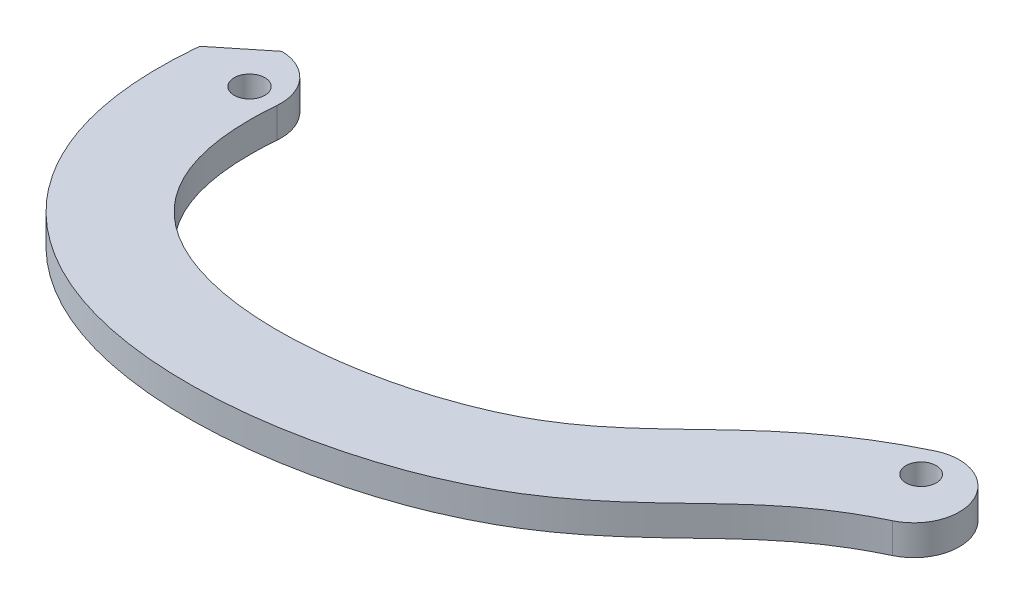
ISO-10303-21;
HEADER;
FILE_DESCRIPTION(('STEP AP214'),'2;1');
FILE_NAME('part.step','',(''),(''),'','','');
FILE_SCHEMA(('AUTOMOTIVE_DESIGN { 1 0 10303 214 1 1 1 1 }'));
ENDSEC;
DATA;
#1=APPLICATION_CONTEXT('core data for automotive mechanical design processes');
#2=APPLICATION_PROTOCOL_DEFINITION('international standard','automotive_design',2000,#1);
#3=PRODUCT_CONTEXT('',#1,'mechanical');
#4=PRODUCT('Part','Part','',(#3));
#5=PRODUCT_RELATED_PRODUCT_CATEGORY('part','',(#4));
#6=PRODUCT_DEFINITION_FORMATION('','',#4);
#7=PRODUCT_DEFINITION_CONTEXT('part definition',#1,'design');
#8=PRODUCT_DEFINITION('design','',#6,#7);
#9=PRODUCT_DEFINITION_SHAPE('','',#8);
#10=(LENGTH_UNIT() NAMED_UNIT(*) SI_UNIT(.MILLI.,.METRE.));
#11=(NAMED_UNIT(*) PLANE_ANGLE_UNIT() SI_UNIT($,.RADIAN.));
#12=(NAMED_UNIT(*) SI_UNIT($,.STERADIAN.) SOLID_ANGLE_UNIT());
#13=UNCERTAINTY_MEASURE_WITH_UNIT(LENGTH_MEASURE(1.E-05),#10,'distance_accuracy_value','');
#14=(GEOMETRIC_REPRESENTATION_CONTEXT(3) GLOBAL_UNCERTAINTY_ASSIGNED_CONTEXT((#13)) GLOBAL_UNIT_ASSIGNED_CONTEXT((#10,
#11,#12)) REPRESENTATION_CONTEXT('',''));
#15=CARTESIAN_POINT('',(0.,0.,0.));
#16=DIRECTION('',(0.,0.,1.));
#17=DIRECTION('',(1.,0.,0.));
#18=AXIS2_PLACEMENT_3D('',#15,#16,#17);
#19=CARTESIAN_POINT('',(-36.8876030683505,3.175,-0.136704002078931));
#20=DIRECTION('',(0.,-1.,0.));
#21=DIRECTION('',(0.,0.,-1.));
#22=AXIS2_PLACEMENT_3D('',#19,#20,#21);
#23=CYLINDRICAL_SURFACE('',#22,4.7625);
#24=CARTESIAN_POINT('',(-36.8876030683505,3.175,-0.136704002078931));
#25=DIRECTION('',(0.,1.,0.));
#26=DIRECTION('',(0.,0.,1.));
#27=AXIS2_PLACEMENT_3D('',#24,#25,#26);
#28=CIRCLE('',#27,4.7625);
#29=CARTESIAN_POINT('',(-41.5566026681401,3.175,-1.07577215038553));
#30=VERTEX_POINT('',#29);
#31=CARTESIAN_POINT('',(-41.6324122734018,3.175,-0.546816008315833));
#32=VERTEX_POINT('',#31);
#33=EDGE_CURVE('E109',#30,#32,#28,.T.);
#34=ORIENTED_EDGE('',*,*,#33,.F.);
#35=DIRECTION('',(0.,1.,0.));
#36=VECTOR('',#35,1.);
#37=CARTESIAN_POINT('',(-41.5566026681401,-0.00100000000000013,-1.07577215038553));
#38=LINE('',#37,#36);
#39=CARTESIAN_POINT('',(-41.5566026681401,0.,-1.07577215038552));
#40=VERTEX_POINT('',#39);
#41=EDGE_CURVE('E97',#40,#30,#38,.T.);
#42=ORIENTED_EDGE('',*,*,#41,.F.);
#43=CARTESIAN_POINT('',(-36.8876030683505,0.,-0.136704002078931));
#44=DIRECTION('',(0.,1.,0.));
#45=DIRECTION('',(0.,0.,1.));
#46=AXIS2_PLACEMENT_3D('',#43,#44,#45);
#47=CIRCLE('',#46,4.7625);
#48=CARTESIAN_POINT('',(-41.6324122734018,0.,-0.546816008315833));
#49=VERTEX_POINT('',#48);
#50=EDGE_CURVE('E107',#40,#49,#47,.T.);
#51=ORIENTED_EDGE('',*,*,#50,.T.);
#52=DIRECTION('',(0.,-1.,0.));
#53=VECTOR('',#52,1.);
#54=CARTESIAN_POINT('',(-41.6324122734018,3.175,-0.546816008315833));
#55=LINE('',#54,#53);
#56=EDGE_CURVE('E42',#32,#49,#55,.T.);
#57=ORIENTED_EDGE('',*,*,#56,.F.);
#58=EDGE_LOOP('',(#34,#42,#51,#57));
#59=FACE_BOUND('',#58,.T.);
#60=ADVANCED_FACE('F33',(#59),#23,.T.);
#61=CARTESIAN_POINT('',(0.276244126705238,3.175,19.1480218934429));
#62=DIRECTION('',(0.,-1.,0.));
#63=DIRECTION('',(0.,0.,-1.));
#64=AXIS2_PLACEMENT_3D('',#61,#62,#63);
#65=PLANE('',#64);
#66=CARTESIAN_POINT('',(-35.306,3.175,0.));
#67=DIRECTION('',(0.,1.,0.));
#68=DIRECTION('',(0.,0.,1.));
#69=AXIS2_PLACEMENT_3D('',#66,#67,#68);
#70=CIRCLE('',#69,1.6129);
#71=CARTESIAN_POINT('',(-35.306,3.175,1.6129));
#72=VERTEX_POINT('',#71);
#73=EDGE_CURVE('E119',#72,#72,#70,.T.);
#74=ORIENTED_EDGE('',*,*,#73,.F.);
#75=EDGE_LOOP('',(#74));
#76=FACE_BOUND('',#75,.T.);
#77=CARTESIAN_POINT('',(-32.1427938632991,3.175,0.273408004157771));
#78=VERTEX_POINT('',#77);
#79=CARTESIAN_POINT('',(-36.8191064209794,3.175,-4.89871140015161));
#80=VERTEX_POINT('',#79);
#81=EDGE_CURVE('E85',#78,#80,#28,.T.);
#82=ORIENTED_EDGE('',*,*,#81,.T.);
#83=DIRECTION('',(0.778222140709286,0.,-0.62798909203095));
#84=VECTOR('',#83,1.);
#85=CARTESIAN_POINT('',(-41.5566026681401,3.175,-1.07577215038553));
#86=LINE('',#85,#84);
#87=EDGE_CURVE('E49',#30,#80,#86,.T.);
#88=ORIENTED_EDGE('',*,*,#87,.F.);
#89=ORIENTED_EDGE('',*,*,#33,.T.);
#90=CARTESIAN_POINT('',(-41.6324122734018,3.175,-0.546816008315833));
#91=CARTESIAN_POINT('',(-41.7058057722734,3.175,0.302313360590763));
#92=CARTESIAN_POINT('',(-41.8043215706469,3.175,2.02854703687298));
#93=CARTESIAN_POINT('',(-41.7826080772828,3.175,5.3004761865421));
#94=CARTESIAN_POINT('',(-41.3553966560922,3.175,9.19206644921967));
#95=CARTESIAN_POINT('',(-40.1925315005306,3.175,13.487083667295));
#96=CARTESIAN_POINT('',(-38.3927746114627,3.175,17.3645758433994));
#97=CARTESIAN_POINT('',(-36.0146932518326,3.175,20.7448961500249));
#98=CARTESIAN_POINT('',(-32.2139421309163,3.175,24.5143081277758));
#99=CARTESIAN_POINT('',(-26.6182301435388,3.175,27.8003562703575));
#100=CARTESIAN_POINT('',(-19.3302706023553,3.175,29.840555436389));
#101=CARTESIAN_POINT('',(-9.33713531106416,3.175,30.6421626857628));
#102=CARTESIAN_POINT('',(0.576595973916283,3.175,29.2055330133564));
#103=CARTESIAN_POINT('',(9.39642313378584,3.175,26.3157948570633));
#104=CARTESIAN_POINT('',(17.211739573014,3.175,22.4991596586882));
#105=CARTESIAN_POINT('',(22.6799766174534,3.175,17.8315248844971));
#106=CARTESIAN_POINT('',(27.036028795043,3.175,13.5927896356039));
#107=CARTESIAN_POINT('',(29.6483782006457,3.175,11.1986765141133));
#108=CARTESIAN_POINT('',(31.883886811965,3.175,9.42020901960461));
#109=CARTESIAN_POINT('',(33.6931704635134,3.175,8.14318531545747));
#110=CARTESIAN_POINT('',(35.3711383318745,3.175,7.11626119533922));
#111=CARTESIAN_POINT('',(36.8369425745586,3.175,6.32127391792451));
#112=CARTESIAN_POINT('',(37.6384562872675,3.175,5.92246628444626));
#113=CARTESIAN_POINT('',(38.0355866666545,3.175,5.733398349079));
#114=B_SPLINE_CURVE_WITH_KNOTS('',3,(#90,#91,#92,#93,#94,#95,#96,#97,#98,#99,#100,#101,#102,
#103,#104,#105,#106,#107,#108,#109,#110,#111,#112,#113),.UNSPECIFIED.,.F.,.F.,(4,1,1,1,1,1,1,1,
1,1,1,1,1,1,1,1,1,1,1,1,1,4),(0.,0.015625,0.03125,0.0625,0.09375,0.125,0.15625,0.1875,0.25,
0.3125,0.375,0.5,0.5625,0.625,0.75,0.8125,0.875,0.90625,0.9375,0.96875,0.984375,1.),.UNSPECIFIED.);
#115=CARTESIAN_POINT('',(38.0355866666545,3.175,5.733398349079));
#116=VERTEX_POINT('',#115);
#117=EDGE_CURVE('E140',#32,#116,#114,.T.);
#118=ORIENTED_EDGE('',*,*,#117,.T.);
#119=CARTESIAN_POINT('',(35.9883966666636,3.175,1.43334958726975));
#120=DIRECTION('',(0.,1.,0.));
#121=DIRECTION('',(0.,0.,1.));
#122=AXIS2_PLACEMENT_3D('',#119,#120,#121);
#123=CIRCLE('',#122,4.7625);
#124=CARTESIAN_POINT('',(33.9412066666727,3.175,-2.8666991745395));
#125=VERTEX_POINT('',#124);
#126=EDGE_CURVE('E58',#116,#125,#123,.T.);
#127=ORIENTED_EDGE('',*,*,#126,.T.);
#128=CARTESIAN_POINT('',(33.9412066666727,3.175,-2.8666991745395));
#129=CARTESIAN_POINT('',(33.4448627450034,3.175,-2.63039713024124));
#130=CARTESIAN_POINT('',(32.4466782514353,3.175,-2.13375314409141));
#131=CARTESIAN_POINT('',(30.5934552223409,3.175,-1.12900381134608));
#132=CARTESIAN_POINT('',(28.4545023423351,3.175,0.179932070212591));
#133=CARTESIAN_POINT('',(26.1587644148589,3.175,1.80102989143851));
#134=CARTESIAN_POINT('',(23.3976392536054,3.175,4.00021102597051));
#135=CARTESIAN_POINT('',(20.4088331178695,3.175,6.75120043533924));
#136=CARTESIAN_POINT('',(17.1994766487981,3.175,9.87171553730923));
#137=CARTESIAN_POINT('',(13.993340911202,3.175,12.7004341255478));
#138=CARTESIAN_POINT('',(10.9919504992823,3.175,14.7963011446173));
#139=CARTESIAN_POINT('',(8.16668216308464,3.175,16.3134920630876));
#140=CARTESIAN_POINT('',(4.95671295586056,3.175,17.7335997707681));
#141=CARTESIAN_POINT('',(0.363730133248862,3.175,19.2503437952836));
#142=CARTESIAN_POINT('',(-5.67276529314692,3.175,20.4565052136582));
#143=CARTESIAN_POINT('',(-11.837126413049,3.175,20.8832160653328));
#144=CARTESIAN_POINT('',(-17.7297833190942,3.175,20.3928708261273));
#145=CARTESIAN_POINT('',(-22.9525094103198,3.175,18.8930941474626));
#146=CARTESIAN_POINT('',(-26.4625885174985,3.175,16.7906885386359));
#147=CARTESIAN_POINT('',(-28.6983739921393,3.175,14.567923674936));
#148=CARTESIAN_POINT('',(-30.0909431067082,3.175,12.5911629497231));
#149=CARTESIAN_POINT('',(-31.1867122867317,3.175,10.2453481674979));
#150=CARTESIAN_POINT('',(-31.8225309258208,3.175,7.92535186466461));
#151=CARTESIAN_POINT('',(-32.135142613354,3.175,5.82120043980168));
#152=CARTESIAN_POINT('',(-32.2630781410807,3.175,4.11485299341573));
#153=CARTESIAN_POINT('',(-32.2734859333362,3.175,2.57895942911467));
#154=CARTESIAN_POINT('',(-32.2205038717937,3.175,1.2880187958769));
#155=CARTESIAN_POINT('',(-32.1717464367807,3.175,0.608376098425879));
#156=CARTESIAN_POINT('',(-32.1427938632991,3.175,0.273408004157772));
#157=B_SPLINE_CURVE_WITH_KNOTS('',3,(#128,#129,#130,#131,#132,#133,#134,#135,#136,#137,#138,
#139,#140,#141,#142,#143,#144,#145,#146,#147,#148,#149,#150,#151,#152,#153,#154,#155,#156),
.UNSPECIFIED.,.F.,.F.,(4,1,1,1,1,1,1,1,1,1,1,1,1,1,1,1,1,1,1,1,1,1,1,1,1,1,4),(0.,0.015625,
0.03125,0.0625,0.09375,0.125,0.1875,0.25,0.3125,0.375,0.40625,0.4375,0.5,0.5625,0.625,0.6875,
0.75,0.8125,0.84375,0.875,0.90625,0.9375,0.953125,0.96875,0.984375,0.9921875,1.),.UNSPECIFIED.);
#158=EDGE_CURVE('E132',#125,#78,#157,.T.);
#159=ORIENTED_EDGE('',*,*,#158,.T.);
#160=EDGE_LOOP('',(#82,#88,#89,#118,#127,#159));
#161=FACE_BOUND('',#160,.T.);
#162=CARTESIAN_POINT('',(35.306,3.175,0.));
#163=DIRECTION('',(0.,1.,0.));
#164=DIRECTION('',(0.,0.,1.));
#165=AXIS2_PLACEMENT_3D('',#162,#163,#164);
#166=CIRCLE('',#165,1.5875);
#167=CARTESIAN_POINT('',(35.306,3.175,1.5875));
#168=VERTEX_POINT('',#167);
#169=EDGE_CURVE('E239',#168,#168,#166,.T.);
#170=ORIENTED_EDGE('',*,*,#169,.F.);
#171=EDGE_LOOP('',(#170));
#172=FACE_BOUND('',#171,.T.);
#173=ADVANCED_FACE('F163',(#76,#161,#172),#65,.F.);
#174=CARTESIAN_POINT('',(0.276244126705238,0.,19.1480218934429));
#175=DIRECTION('',(0.,-1.,0.));
#176=DIRECTION('',(0.,0.,-1.));
#177=AXIS2_PLACEMENT_3D('',#174,#175,#176);
#178=PLANE('',#177);
#179=DIRECTION('',(0.778222140709286,0.,-0.62798909203095));
#180=VECTOR('',#179,1.);
#181=CARTESIAN_POINT('',(-41.5566026681401,0.,-1.07577215038553));
#182=LINE('',#181,#180);
#183=CARTESIAN_POINT('',(-36.8191064209794,0.,-4.8987114001516));
#184=VERTEX_POINT('',#183);
#185=EDGE_CURVE('E94',#40,#184,#182,.T.);
#186=ORIENTED_EDGE('',*,*,#185,.T.);
#187=CARTESIAN_POINT('',(-32.1427938632991,0.,0.273408004157771));
#188=VERTEX_POINT('',#187);
#189=EDGE_CURVE('E115',#188,#184,#47,.T.);
#190=ORIENTED_EDGE('',*,*,#189,.F.);
#191=CARTESIAN_POINT('',(33.9412066666727,0.,-2.8666991745395));
#192=CARTESIAN_POINT('',(33.4448627450034,0.,-2.63039713024124));
#193=CARTESIAN_POINT('',(32.4466782514353,0.,-2.13375314409141));
#194=CARTESIAN_POINT('',(30.5934552223409,0.,-1.12900381134608));
#195=CARTESIAN_POINT('',(28.4545023423351,0.,0.179932070212591));
#196=CARTESIAN_POINT('',(26.1587644148589,0.,1.80102989143851));
#197=CARTESIAN_POINT('',(23.3976392536054,0.,4.00021102597051));
#198=CARTESIAN_POINT('',(20.4088331178695,0.,6.75120043533924));
#199=CARTESIAN_POINT('',(17.1994766487981,0.,9.87171553730923));
#200=CARTESIAN_POINT('',(13.993340911202,0.,12.7004341255478));
#201=CARTESIAN_POINT('',(10.9919504992823,0.,14.7963011446173));
#202=CARTESIAN_POINT('',(8.16668216308464,0.,16.3134920630876));
#203=CARTESIAN_POINT('',(4.95671295586056,0.,17.7335997707681));
#204=CARTESIAN_POINT('',(0.363730133248862,0.,19.2503437952836));
#205=CARTESIAN_POINT('',(-5.67276529314692,0.,20.4565052136582));
#206=CARTESIAN_POINT('',(-11.837126413049,0.,20.8832160653328));
#207=CARTESIAN_POINT('',(-17.7297833190942,0.,20.3928708261273));
#208=CARTESIAN_POINT('',(-22.9525094103198,0.,18.8930941474626));
#209=CARTESIAN_POINT('',(-26.4625885174985,0.,16.7906885386359));
#210=CARTESIAN_POINT('',(-28.6983739921393,0.,14.567923674936));
#211=CARTESIAN_POINT('',(-30.0909431067082,0.,12.5911629497231));
#212=CARTESIAN_POINT('',(-31.1867122867317,0.,10.2453481674979));
#213=CARTESIAN_POINT('',(-31.8225309258208,0.,7.92535186466461));
#214=CARTESIAN_POINT('',(-32.135142613354,0.,5.82120043980168));
#215=CARTESIAN_POINT('',(-32.2630781410807,0.,4.11485299341573));
#216=CARTESIAN_POINT('',(-32.2734859333362,0.,2.57895942911467));
#217=CARTESIAN_POINT('',(-32.2205038717937,0.,1.2880187958769));
#218=CARTESIAN_POINT('',(-32.1717464367807,0.,0.608376098425879));
#219=CARTESIAN_POINT('',(-32.1427938632991,0.,0.273408004157772));
#220=B_SPLINE_CURVE_WITH_KNOTS('',3,(#191,#192,#193,#194,#195,#196,#197,#198,#199,#200,#201,
#202,#203,#204,#205,#206,#207,#208,#209,#210,#211,#212,#213,#214,#215,#216,#217,#218,#219),
.UNSPECIFIED.,.F.,.F.,(4,1,1,1,1,1,1,1,1,1,1,1,1,1,1,1,1,1,1,1,1,1,1,1,1,1,4),(0.,0.015625,
0.03125,0.0625,0.09375,0.125,0.1875,0.25,0.3125,0.375,0.40625,0.4375,0.5,0.5625,0.625,0.6875,
0.75,0.8125,0.84375,0.875,0.90625,0.9375,0.953125,0.96875,0.984375,0.9921875,1.),.UNSPECIFIED.);
#221=CARTESIAN_POINT('',(33.9412066666727,0.,-2.8666991745395));
#222=VERTEX_POINT('',#221);
#223=EDGE_CURVE('E116',#222,#188,#220,.T.);
#224=ORIENTED_EDGE('',*,*,#223,.F.);
#225=CARTESIAN_POINT('',(35.9883966666636,0.,1.43334958726975));
#226=DIRECTION('',(0.,1.,0.));
#227=DIRECTION('',(0.,0.,1.));
#228=AXIS2_PLACEMENT_3D('',#225,#226,#227);
#229=CIRCLE('',#228,4.7625);
#230=CARTESIAN_POINT('',(38.0355866666545,0.,5.733398349079));
#231=VERTEX_POINT('',#230);
#232=EDGE_CURVE('E79',#231,#222,#229,.T.);
#233=ORIENTED_EDGE('',*,*,#232,.F.);
#234=CARTESIAN_POINT('',(-41.6324122734018,0.,-0.546816008315833));
#235=CARTESIAN_POINT('',(-41.7058057722734,0.,0.302313360590763));
#236=CARTESIAN_POINT('',(-41.8043215706469,0.,2.02854703687298));
#237=CARTESIAN_POINT('',(-41.7826080772828,0.,5.3004761865421));
#238=CARTESIAN_POINT('',(-41.3553966560922,0.,9.19206644921967));
#239=CARTESIAN_POINT('',(-40.1925315005306,0.,13.487083667295));
#240=CARTESIAN_POINT('',(-38.3927746114627,0.,17.3645758433994));
#241=CARTESIAN_POINT('',(-36.0146932518326,0.,20.7448961500249));
#242=CARTESIAN_POINT('',(-32.2139421309163,0.,24.5143081277758));
#243=CARTESIAN_POINT('',(-26.6182301435388,0.,27.8003562703575));
#244=CARTESIAN_POINT('',(-19.3302706023553,0.,29.840555436389));
#245=CARTESIAN_POINT('',(-9.33713531106416,0.,30.6421626857628));
#246=CARTESIAN_POINT('',(0.576595973916283,0.,29.2055330133564));
#247=CARTESIAN_POINT('',(9.39642313378584,0.,26.3157948570633));
#248=CARTESIAN_POINT('',(17.211739573014,0.,22.4991596586882));
#249=CARTESIAN_POINT('',(22.6799766174534,0.,17.8315248844971));
#250=CARTESIAN_POINT('',(27.036028795043,0.,13.5927896356039));
#251=CARTESIAN_POINT('',(29.6483782006457,0.,11.1986765141133));
#252=CARTESIAN_POINT('',(31.883886811965,0.,9.42020901960461));
#253=CARTESIAN_POINT('',(33.6931704635134,0.,8.14318531545747));
#254=CARTESIAN_POINT('',(35.3711383318745,0.,7.11626119533922));
#255=CARTESIAN_POINT('',(36.8369425745586,0.,6.32127391792451));
#256=CARTESIAN_POINT('',(37.6384562872675,0.,5.92246628444626));
#257=CARTESIAN_POINT('',(38.0355866666545,0.,5.733398349079));
#258=B_SPLINE_CURVE_WITH_KNOTS('',3,(#234,#235,#236,#237,#238,#239,#240,#241,#242,#243,#244,
#245,#246,#247,#248,#249,#250,#251,#252,#253,#254,#255,#256,#257),.UNSPECIFIED.,.F.,.F.,(4,1,1,
1,1,1,1,1,1,1,1,1,1,1,1,1,1,1,1,1,1,4),(0.,0.015625,0.03125,0.0625,0.09375,0.125,0.15625,0.1875,
0.25,0.3125,0.375,0.5,0.5625,0.625,0.75,0.8125,0.875,0.90625,0.9375,0.96875,0.984375,1.),.UNSPECIFIED.);
#259=EDGE_CURVE('E114',#49,#231,#258,.T.);
#260=ORIENTED_EDGE('',*,*,#259,.F.);
#261=ORIENTED_EDGE('',*,*,#50,.F.);
#262=EDGE_LOOP('',(#186,#190,#224,#233,#260,#261));
#263=FACE_BOUND('',#262,.T.);
#264=CARTESIAN_POINT('',(-35.306,0.,0.));
#265=DIRECTION('',(0.,1.,0.));
#266=DIRECTION('',(0.,0.,1.));
#267=AXIS2_PLACEMENT_3D('',#264,#265,#266);
#268=CIRCLE('',#267,1.6129);
#269=CARTESIAN_POINT('',(-35.306,0.,1.6129));
#270=VERTEX_POINT('',#269);
#271=EDGE_CURVE('E244',#270,#270,#268,.T.);
#272=ORIENTED_EDGE('',*,*,#271,.T.);
#273=EDGE_LOOP('',(#272));
#274=FACE_BOUND('',#273,.T.);
#275=CARTESIAN_POINT('',(35.306,0.,0.));
#276=DIRECTION('',(0.,1.,0.));
#277=DIRECTION('',(0.,0.,1.));
#278=AXIS2_PLACEMENT_3D('',#275,#276,#277);
#279=CIRCLE('',#278,1.5875);
#280=CARTESIAN_POINT('',(35.306,0.,1.5875));
#281=VERTEX_POINT('',#280);
#282=EDGE_CURVE('E102',#281,#281,#279,.T.);
#283=ORIENTED_EDGE('',*,*,#282,.T.);
#284=EDGE_LOOP('',(#283));
#285=FACE_BOUND('',#284,.T.);
#286=ADVANCED_FACE('F112',(#263,#274,#285),#178,.T.);
#287=DIRECTION('',(0.,-1.,0.));
#288=VECTOR('',#287,1.);
#289=SURFACE_OF_LINEAR_EXTRUSION('',#157,#288);
#290=ORIENTED_EDGE('',*,*,#223,.T.);
#291=DIRECTION('',(0.,-1.,0.));
#292=VECTOR('',#291,1.);
#293=CARTESIAN_POINT('',(-32.1427938632991,3.175,0.273408004157771));
#294=LINE('',#293,#292);
#295=EDGE_CURVE('E11',#78,#188,#294,.T.);
#296=ORIENTED_EDGE('',*,*,#295,.F.);
#297=ORIENTED_EDGE('',*,*,#158,.F.);
#298=DIRECTION('',(0.,-1.,0.));
#299=VECTOR('',#298,1.);
#300=CARTESIAN_POINT('',(33.9412066666727,3.175,-2.8666991745395));
#301=LINE('',#300,#299);
#302=EDGE_CURVE('E133',#125,#222,#301,.T.);
#303=ORIENTED_EDGE('',*,*,#302,.T.);
#304=EDGE_LOOP('',(#290,#296,#297,#303));
#305=FACE_BOUND('',#304,.T.);
#306=ADVANCED_FACE('F35',(#305),#289,.F.);
#307=ORIENTED_EDGE('',*,*,#189,.T.);
#308=DIRECTION('',(0.,1.,0.));
#309=VECTOR('',#308,1.);
#310=CARTESIAN_POINT('',(-36.8191064209794,-0.00100000000000013,-4.8987114001516));
#311=LINE('',#310,#309);
#312=EDGE_CURVE('E98',#184,#80,#311,.T.);
#313=ORIENTED_EDGE('',*,*,#312,.T.);
#314=ORIENTED_EDGE('',*,*,#81,.F.);
#315=ORIENTED_EDGE('',*,*,#295,.T.);
#316=EDGE_LOOP('',(#307,#313,#314,#315));
#317=FACE_BOUND('',#316,.T.);
#318=ADVANCED_FACE('F153',(#317),#23,.T.);
#319=DIRECTION('',(0.,-1.,0.));
#320=VECTOR('',#319,1.);
#321=SURFACE_OF_LINEAR_EXTRUSION('',#114,#320);
#322=ORIENTED_EDGE('',*,*,#259,.T.);
#323=DIRECTION('',(0.,-1.,0.));
#324=VECTOR('',#323,1.);
#325=CARTESIAN_POINT('',(38.0355866666545,3.175,5.733398349079));
#326=LINE('',#325,#324);
#327=EDGE_CURVE('E135',#116,#231,#326,.T.);
#328=ORIENTED_EDGE('',*,*,#327,.F.);
#329=ORIENTED_EDGE('',*,*,#117,.F.);
#330=ORIENTED_EDGE('',*,*,#56,.T.);
#331=EDGE_LOOP('',(#322,#328,#329,#330));
#332=FACE_BOUND('',#331,.T.);
#333=ADVANCED_FACE('F138',(#332),#321,.F.);
#334=CARTESIAN_POINT('',(35.9883966666636,3.175,1.43334958726975));
#335=DIRECTION('',(0.,-1.,0.));
#336=DIRECTION('',(0.,0.,-1.));
#337=AXIS2_PLACEMENT_3D('',#334,#335,#336);
#338=CYLINDRICAL_SURFACE('',#337,4.7625);
#339=ORIENTED_EDGE('',*,*,#232,.T.);
#340=ORIENTED_EDGE('',*,*,#302,.F.);
#341=ORIENTED_EDGE('',*,*,#126,.F.);
#342=ORIENTED_EDGE('',*,*,#327,.T.);
#343=EDGE_LOOP('',(#339,#340,#341,#342));
#344=FACE_BOUND('',#343,.T.);
#345=ADVANCED_FACE('F152',(#344),#338,.T.);
#346=CARTESIAN_POINT('',(-35.306,3.175,0.));
#347=DIRECTION('',(0.,-1.,0.));
#348=DIRECTION('',(0.,0.,-1.));
#349=AXIS2_PLACEMENT_3D('',#346,#347,#348);
#350=CYLINDRICAL_SURFACE('',#349,1.6129);
#351=ORIENTED_EDGE('',*,*,#73,.T.);
#352=EDGE_LOOP('',(#351));
#353=FACE_BOUND('',#352,.T.);
#354=ORIENTED_EDGE('',*,*,#271,.F.);
#355=EDGE_LOOP('',(#354));
#356=FACE_BOUND('',#355,.T.);
#357=ADVANCED_FACE('F174',(#353,#356),#350,.F.);
#358=CARTESIAN_POINT('',(35.306,3.175,0.));
#359=DIRECTION('',(0.,-1.,0.));
#360=DIRECTION('',(0.,0.,-1.));
#361=AXIS2_PLACEMENT_3D('',#358,#359,#360);
#362=CYLINDRICAL_SURFACE('',#361,1.5875);
#363=ORIENTED_EDGE('',*,*,#169,.T.);
#364=EDGE_LOOP('',(#363));
#365=FACE_BOUND('',#364,.T.);
#366=ORIENTED_EDGE('',*,*,#282,.F.);
#367=EDGE_LOOP('',(#366));
#368=FACE_BOUND('',#367,.T.);
#369=ADVANCED_FACE('F177',(#365,#368),#362,.F.);
#370=CARTESIAN_POINT('',(-41.5566026681401,-0.00100000000000013,-1.07577215038553));
#371=DIRECTION('',(0.62798909203095,0.,0.778222140709286));
#372=DIRECTION('',(0.778222140709286,0.,-0.62798909203095));
#373=AXIS2_PLACEMENT_3D('',#370,#371,#372);
#374=PLANE('',#373);
#375=ORIENTED_EDGE('',*,*,#41,.T.);
#376=ORIENTED_EDGE('',*,*,#87,.T.);
#377=ORIENTED_EDGE('',*,*,#312,.F.);
#378=ORIENTED_EDGE('',*,*,#185,.F.);
#379=EDGE_LOOP('',(#375,#376,#377,#378));
#380=FACE_BOUND('',#379,.T.);
#381=ADVANCED_FACE('F96',(#380),#374,.F.);
#382=CLOSED_SHELL('',(#60,#173,#286,#306,#318,#333,#345,#357,#369,#381));
#383=MANIFOLD_SOLID_BREP('B2',#382);
#384=ADVANCED_BREP_SHAPE_REPRESENTATION('',(#18,#383),#14);
#385=SHAPE_DEFINITION_REPRESENTATION(#9,#384);
ENDSEC;
END-ISO-10303-21;
